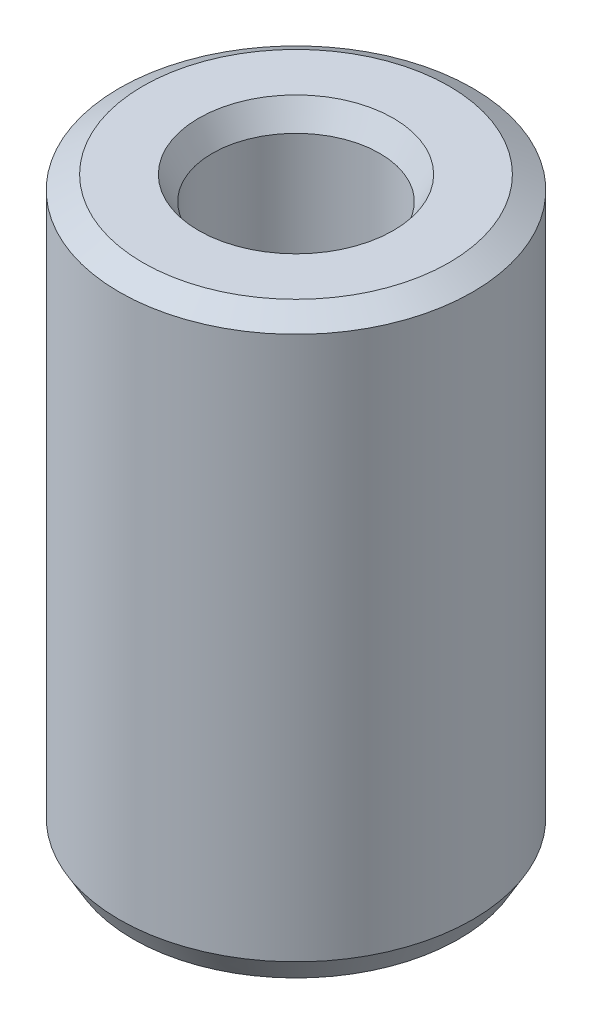
ISO-10303-21;
HEADER;
FILE_DESCRIPTION(('STEP AP214'),'2;1');
FILE_NAME('part.step','',(''),(''),'','','');
FILE_SCHEMA(('AUTOMOTIVE_DESIGN { 1 0 10303 214 1 1 1 1 }'));
ENDSEC;
DATA;
#1=APPLICATION_CONTEXT('core data for automotive mechanical design processes');
#2=APPLICATION_PROTOCOL_DEFINITION('international standard','automotive_design',2000,#1);
#3=PRODUCT_CONTEXT('',#1,'mechanical');
#4=PRODUCT('Part','Part','',(#3));
#5=PRODUCT_RELATED_PRODUCT_CATEGORY('part','',(#4));
#6=PRODUCT_DEFINITION_FORMATION('','',#4);
#7=PRODUCT_DEFINITION_CONTEXT('part definition',#1,'design');
#8=PRODUCT_DEFINITION('design','',#6,#7);
#9=PRODUCT_DEFINITION_SHAPE('','',#8);
#10=(LENGTH_UNIT() NAMED_UNIT(*) SI_UNIT(.MILLI.,.METRE.));
#11=(NAMED_UNIT(*) PLANE_ANGLE_UNIT() SI_UNIT($,.RADIAN.));
#12=(NAMED_UNIT(*) SI_UNIT($,.STERADIAN.) SOLID_ANGLE_UNIT());
#13=UNCERTAINTY_MEASURE_WITH_UNIT(LENGTH_MEASURE(1.E-05),#10,'distance_accuracy_value','');
#14=(GEOMETRIC_REPRESENTATION_CONTEXT(3) GLOBAL_UNCERTAINTY_ASSIGNED_CONTEXT((#13)) GLOBAL_UNIT_ASSIGNED_CONTEXT((#10,
#11,#12)) REPRESENTATION_CONTEXT('',''));
#15=CARTESIAN_POINT('',(0.,0.,0.));
#16=DIRECTION('',(0.,0.,1.));
#17=DIRECTION('',(1.,0.,0.));
#18=AXIS2_PLACEMENT_3D('',#15,#16,#17);
#19=CARTESIAN_POINT('',(0.,115.049599353986,0.));
#20=DIRECTION('',(0.,-1.,0.));
#21=DIRECTION('',(0.,0.,-1.));
#22=AXIS2_PLACEMENT_3D('',#19,#20,#21);
#23=CYLINDRICAL_SURFACE('',#22,35.);
#24=CARTESIAN_POINT('',(0.,4.67939836817344,0.));
#25=DIRECTION('',(0.,1.,0.));
#26=DIRECTION('',(0.,0.,1.));
#27=AXIS2_PLACEMENT_3D('',#24,#25,#26);
#28=CIRCLE('',#27,35.);
#29=CARTESIAN_POINT('',(0.,4.67939836817344,-35.));
#30=VERTEX_POINT('',#29);
#31=EDGE_CURVE('E10',#30,#30,#28,.T.);
#32=CARTESIAN_POINT('',(0.,112.347947446476,0.));
#33=DIRECTION('',(0.,1.,0.));
#34=DIRECTION('',(0.,0.,1.));
#35=AXIS2_PLACEMENT_3D('',#32,#33,#34);
#36=CIRCLE('',#35,35.);
#37=CARTESIAN_POINT('',(0.,112.347947446476,-35.));
#38=VERTEX_POINT('',#37);
#39=EDGE_CURVE('E50',#38,#38,#36,.F.);
#40=CARTESIAN_POINT('',(0.,4.67939836817344,-35.));
#41=CARTESIAN_POINT('',(0.,5.80094575440575,-35.));
#42=CARTESIAN_POINT('',(0.,6.92249314063807,-35.));
#43=CARTESIAN_POINT('',(0.,9.1655879131027,-35.));
#44=CARTESIAN_POINT('',(0.,10.287135299335,-35.));
#45=CARTESIAN_POINT('',(0.,12.5302300717996,-35.));
#46=CARTESIAN_POINT('',(0.,13.6517774580319,-35.));
#47=CARTESIAN_POINT('',(0.,15.8948722304966,-35.));
#48=CARTESIAN_POINT('',(0.,17.0164196167289,-35.));
#49=CARTESIAN_POINT('',(0.,19.2595143891935,-35.));
#50=CARTESIAN_POINT('',(0.,20.3810617754258,-35.));
#51=CARTESIAN_POINT('',(0.,22.6241565478905,-35.));
#52=CARTESIAN_POINT('',(0.,23.7457039341228,-35.));
#53=CARTESIAN_POINT('',(0.,25.9887987065874,-35.));
#54=CARTESIAN_POINT('',(0.,27.1103460928197,-35.));
#55=CARTESIAN_POINT('',(0.,29.3534408652843,-35.));
#56=CARTESIAN_POINT('',(0.,30.4749882515167,-35.));
#57=CARTESIAN_POINT('',(0.,32.7180830239813,-35.));
#58=CARTESIAN_POINT('',(0.,33.8396304102136,-35.));
#59=CARTESIAN_POINT('',(0.,36.0827251826782,-35.));
#60=CARTESIAN_POINT('',(0.,37.2042725689105,-35.));
#61=CARTESIAN_POINT('',(0.,39.4473673413752,-35.));
#62=CARTESIAN_POINT('',(0.,40.5689147276075,-35.));
#63=CARTESIAN_POINT('',(0.,42.8120095000721,-35.));
#64=CARTESIAN_POINT('',(0.,43.9335568863044,-35.));
#65=CARTESIAN_POINT('',(0.,46.1766516587691,-35.));
#66=CARTESIAN_POINT('',(0.,47.2981990450014,-35.));
#67=CARTESIAN_POINT('',(0.,49.541293817466,-35.));
#68=CARTESIAN_POINT('',(0.,50.6628412036983,-35.));
#69=CARTESIAN_POINT('',(0.,52.9059359761629,-35.));
#70=CARTESIAN_POINT('',(0.,54.0274833623952,-35.));
#71=CARTESIAN_POINT('',(0.,56.2705781348599,-35.));
#72=CARTESIAN_POINT('',(0.,57.3921255210922,-35.));
#73=CARTESIAN_POINT('',(0.,59.6352202935568,-35.));
#74=CARTESIAN_POINT('',(0.,60.7567676797891,-35.));
#75=CARTESIAN_POINT('',(0.,62.9998624522538,-35.));
#76=CARTESIAN_POINT('',(0.,64.1214098384861,-35.));
#77=CARTESIAN_POINT('',(0.,66.3645046109507,-35.));
#78=CARTESIAN_POINT('',(0.,67.486051997183,-35.));
#79=CARTESIAN_POINT('',(0.,69.7291467696476,-35.));
#80=CARTESIAN_POINT('',(0.,70.8506941558799,-35.));
#81=CARTESIAN_POINT('',(0.,73.0937889283446,-35.));
#82=CARTESIAN_POINT('',(0.,74.2153363145769,-35.));
#83=CARTESIAN_POINT('',(0.,76.4584310870415,-35.));
#84=CARTESIAN_POINT('',(0.,77.5799784732738,-35.));
#85=CARTESIAN_POINT('',(0.,79.8230732457385,-35.));
#86=CARTESIAN_POINT('',(0.,80.9446206319708,-35.));
#87=CARTESIAN_POINT('',(0.,83.1877154044354,-35.));
#88=CARTESIAN_POINT('',(0.,84.3092627906677,-35.));
#89=CARTESIAN_POINT('',(0.,86.5523575631323,-35.));
#90=CARTESIAN_POINT('',(0.,87.6739049493647,-35.));
#91=CARTESIAN_POINT('',(0.,89.9169997218293,-35.));
#92=CARTESIAN_POINT('',(0.,91.0385471080616,-35.));
#93=CARTESIAN_POINT('',(0.,93.2816418805262,-35.));
#94=CARTESIAN_POINT('',(0.,94.4031892667585,-35.));
#95=CARTESIAN_POINT('',(0.,96.6462840392232,-35.));
#96=CARTESIAN_POINT('',(0.,97.7678314254555,-35.));
#97=CARTESIAN_POINT('',(0.,100.01092619792,-35.));
#98=CARTESIAN_POINT('',(0.,101.132473584152,-35.));
#99=CARTESIAN_POINT('',(0.,103.375568356617,-35.));
#100=CARTESIAN_POINT('',(0.,104.497115742849,-35.));
#101=CARTESIAN_POINT('',(0.,106.740210515314,-35.));
#102=CARTESIAN_POINT('',(0.,107.861757901546,-35.));
#103=CARTESIAN_POINT('',(0.,110.104852674011,-35.));
#104=CARTESIAN_POINT('',(0.,111.226400060243,-35.));
#105=CARTESIAN_POINT('',(0.,112.347947446476,-35.));
#106=B_SPLINE_CURVE_WITH_KNOTS('',3,(#40,#41,#42,#43,#44,#45,#46,#47,#48,#49,#50,#51,#52,#53,
#54,#55,#56,#57,#58,#59,#60,#61,#62,#63,#64,#65,#66,#67,#68,#69,#70,#71,#72,#73,#74,#75,#76,#77,
#78,#79,#80,#81,#82,#83,#84,#85,#86,#87,#88,#89,#90,#91,#92,#93,#94,#95,#96,#97,#98,#99,#100,
#101,#102,#103,#104,#105),.UNSPECIFIED.,.F.,.F.,(4,2,2,2,2,2,2,2,2,2,2,2,2,2,2,2,2,2,2,2,2,2,2,
2,2,2,2,2,2,2,2,2,4),(0.,3.36464215869695,6.72928431739389,10.0939264760908,13.4585686347878,
16.8232107934847,20.1878529521816,23.5524951108786,26.9171372695755,30.2817794282725,
33.6464215869694,37.0110637456664,40.3757059043633,43.7403480630603,47.1049902217572,
50.4696323804541,53.8342745391511,57.198916697848,60.563558856545,63.9282010152419,
67.2928431739388,70.6574853326358,74.0221274913327,77.3867696500297,80.7514118087266,
84.1160539674235,87.4806961261205,90.8453382848174,94.2099804435144,97.5746226022113,
100.939264760908,104.303906919605,107.668549078302),.UNSPECIFIED.);
#107=EDGE_CURVE('BSEAM39',#30,#38,#106,.T.);
#108=ORIENTED_EDGE('',*,*,#31,.T.);
#109=ORIENTED_EDGE('',*,*,#39,.T.);
#110=ORIENTED_EDGE('',*,*,#107,.T.);
#111=ORIENTED_EDGE('',*,*,#107,.F.);
#112=EDGE_LOOP('',(#108,#110,#109,#111));
#113=FACE_BOUND('',#112,.T.);
#114=ADVANCED_FACE('F39',(#113),#23,.T.);
#115=CARTESIAN_POINT('',(0.,115.049599353986,0.));
#116=DIRECTION('',(0.,1.,0.));
#117=DIRECTION('',(0.,0.,1.));
#118=AXIS2_PLACEMENT_3D('',#115,#116,#117);
#119=PLANE('',#118);
#120=CARTESIAN_POINT('',(0.,115.049599353986,0.));
#121=DIRECTION('',(0.,1.,0.));
#122=DIRECTION('',(0.,0.,1.));
#123=AXIS2_PLACEMENT_3D('',#120,#121,#122);
#124=CIRCLE('',#123,19.2877611381571);
#125=CARTESIAN_POINT('',(0.,115.049599353986,19.2877611381571));
#126=VERTEX_POINT('',#125);
#127=EDGE_CURVE('E58',#126,#126,#124,.F.);
#128=ORIENTED_EDGE('',*,*,#127,.T.);
#129=EDGE_LOOP('',(#128));
#130=FACE_BOUND('',#129,.T.);
#131=CARTESIAN_POINT('',(0.,115.049599353986,0.));
#132=DIRECTION('',(0.,1.,0.));
#133=DIRECTION('',(0.,0.,1.));
#134=AXIS2_PLACEMENT_3D('',#131,#132,#133);
#135=CIRCLE('',#134,30.3206016318269);
#136=CARTESIAN_POINT('',(0.,115.049599353986,30.3206016318269));
#137=VERTEX_POINT('',#136);
#138=EDGE_CURVE('E61',#137,#137,#135,.T.);
#139=ORIENTED_EDGE('',*,*,#138,.T.);
#140=EDGE_LOOP('',(#139));
#141=FACE_BOUND('',#140,.T.);
#142=ADVANCED_FACE('F88',(#130,#141),#119,.T.);
#143=CARTESIAN_POINT('',(0.,0.,0.));
#144=DIRECTION('',(0.,1.,0.));
#145=DIRECTION('',(0.,0.,1.));
#146=AXIS2_PLACEMENT_3D('',#143,#144,#145);
#147=PLANE('',#146);
#148=CARTESIAN_POINT('',(0.,0.,0.));
#149=DIRECTION('',(0.,1.,0.));
#150=DIRECTION('',(0.,0.,1.));
#151=AXIS2_PLACEMENT_3D('',#148,#149,#150);
#152=CIRCLE('',#151,21.2655075988197);
#153=CARTESIAN_POINT('',(0.,0.,21.2655075988197));
#154=VERTEX_POINT('',#153);
#155=EDGE_CURVE('E51',#154,#154,#152,.T.);
#156=ORIENTED_EDGE('',*,*,#155,.T.);
#157=EDGE_LOOP('',(#156));
#158=FACE_BOUND('',#157,.T.);
#159=CARTESIAN_POINT('',(0.,0.,0.));
#160=DIRECTION('',(0.,1.,0.));
#161=DIRECTION('',(0.,0.,1.));
#162=AXIS2_PLACEMENT_3D('',#159,#160,#161);
#163=CIRCLE('',#162,32.2983480924896);
#164=CARTESIAN_POINT('',(0.,0.,32.2983480924896));
#165=VERTEX_POINT('',#164);
#166=EDGE_CURVE('E54',#165,#165,#163,.F.);
#167=ORIENTED_EDGE('',*,*,#166,.T.);
#168=EDGE_LOOP('',(#167));
#169=FACE_BOUND('',#168,.T.);
#170=ADVANCED_FACE('F83',(#158,#169),#147,.F.);
#171=CARTESIAN_POINT('',(0.,115.049599353986,0.));
#172=DIRECTION('',(0.,-1.,0.));
#173=DIRECTION('',(0.,0.,-1.));
#174=AXIS2_PLACEMENT_3D('',#171,#172,#173);
#175=CYLINDRICAL_SURFACE('',#174,16.5861092306466);
#176=CARTESIAN_POINT('',(0.,110.370200985812,0.));
#177=DIRECTION('',(0.,1.,0.));
#178=DIRECTION('',(0.,0.,1.));
#179=AXIS2_PLACEMENT_3D('',#176,#177,#178);
#180=CIRCLE('',#179,16.5861092306466);
#181=CARTESIAN_POINT('',(0.,110.370200985812,-16.5861092306466));
#182=VERTEX_POINT('',#181);
#183=EDGE_CURVE('E67',#182,#182,#180,.T.);
#184=CARTESIAN_POINT('',(0.,2.70165190751029,0.));
#185=DIRECTION('',(0.,1.,0.));
#186=DIRECTION('',(0.,0.,1.));
#187=AXIS2_PLACEMENT_3D('',#184,#185,#186);
#188=CIRCLE('',#187,16.5861092306466);
#189=CARTESIAN_POINT('',(0.,2.70165190751029,-16.5861092306466));
#190=VERTEX_POINT('',#189);
#191=EDGE_CURVE('E69',#190,#190,#188,.F.);
#192=CARTESIAN_POINT('',(0.,110.370200985812,-16.5861092306466));
#193=CARTESIAN_POINT('',(0.,109.24865359958,-16.5861092306466));
#194=CARTESIAN_POINT('',(0.,108.127106213348,-16.5861092306466));
#195=CARTESIAN_POINT('',(0.,105.884011440883,-16.5861092306466));
#196=CARTESIAN_POINT('',(0.,104.762464054651,-16.5861092306466));
#197=CARTESIAN_POINT('',(0.,102.519369282186,-16.5861092306466));
#198=CARTESIAN_POINT('',(0.,101.397821895954,-16.5861092306466));
#199=CARTESIAN_POINT('',(0.,99.1547271234893,-16.5861092306466));
#200=CARTESIAN_POINT('',(0.,98.033179737257,-16.5861092306466));
#201=CARTESIAN_POINT('',(0.,95.7900849647923,-16.5861092306466));
#202=CARTESIAN_POINT('',(0.,94.66853757856,-16.5861092306466));
#203=CARTESIAN_POINT('',(0.,92.4254428060954,-16.5861092306466));
#204=CARTESIAN_POINT('',(0.,91.3038954198631,-16.5861092306466));
#205=CARTESIAN_POINT('',(0.,89.0608006473985,-16.5861092306466));
#206=CARTESIAN_POINT('',(0.,87.9392532611661,-16.5861092306466));
#207=CARTESIAN_POINT('',(0.,85.6961584887015,-16.5861092306466));
#208=CARTESIAN_POINT('',(0.,84.5746111024692,-16.5861092306466));
#209=CARTESIAN_POINT('',(0.,82.3315163300046,-16.5861092306466));
#210=CARTESIAN_POINT('',(0.,81.2099689437723,-16.5861092306466));
#211=CARTESIAN_POINT('',(0.,78.9668741713076,-16.5861092306466));
#212=CARTESIAN_POINT('',(0.,77.8453267850753,-16.5861092306466));
#213=CARTESIAN_POINT('',(0.,75.6022320126107,-16.5861092306466));
#214=CARTESIAN_POINT('',(0.,74.4806846263784,-16.5861092306466));
#215=CARTESIAN_POINT('',(0.,72.2375898539137,-16.5861092306466));
#216=CARTESIAN_POINT('',(0.,71.1160424676814,-16.5861092306466));
#217=CARTESIAN_POINT('',(0.,68.8729476952168,-16.5861092306466));
#218=CARTESIAN_POINT('',(0.,67.7514003089845,-16.5861092306466));
#219=CARTESIAN_POINT('',(0.,65.5083055365199,-16.5861092306466));
#220=CARTESIAN_POINT('',(0.,64.3867581502875,-16.5861092306466));
#221=CARTESIAN_POINT('',(0.,62.1436633778229,-16.5861092306466));
#222=CARTESIAN_POINT('',(0.,61.0221159915906,-16.5861092306466));
#223=CARTESIAN_POINT('',(0.,58.779021219126,-16.5861092306466));
#224=CARTESIAN_POINT('',(0.,57.6574738328937,-16.5861092306466));
#225=CARTESIAN_POINT('',(0.,55.414379060429,-16.5861092306466));
#226=CARTESIAN_POINT('',(0.,54.2928316741967,-16.5861092306466));
#227=CARTESIAN_POINT('',(0.,52.0497369017321,-16.5861092306466));
#228=CARTESIAN_POINT('',(0.,50.9281895154998,-16.5861092306466));
#229=CARTESIAN_POINT('',(0.,48.6850947430352,-16.5861092306466));
#230=CARTESIAN_POINT('',(0.,47.5635473568028,-16.5861092306466));
#231=CARTESIAN_POINT('',(0.,45.3204525843382,-16.5861092306466));
#232=CARTESIAN_POINT('',(0.,44.1989051981059,-16.5861092306466));
#233=CARTESIAN_POINT('',(0.,41.9558104256413,-16.5861092306466));
#234=CARTESIAN_POINT('',(0.,40.834263039409,-16.5861092306466));
#235=CARTESIAN_POINT('',(0.,38.5911682669443,-16.5861092306466));
#236=CARTESIAN_POINT('',(0.,37.469620880712,-16.5861092306466));
#237=CARTESIAN_POINT('',(0.,35.2265261082474,-16.5861092306466));
#238=CARTESIAN_POINT('',(0.,34.1049787220151,-16.5861092306466));
#239=CARTESIAN_POINT('',(0.,31.8618839495505,-16.5861092306466));
#240=CARTESIAN_POINT('',(0.,30.7403365633181,-16.5861092306466));
#241=CARTESIAN_POINT('',(0.,28.4972417908535,-16.5861092306466));
#242=CARTESIAN_POINT('',(0.,27.3756944046212,-16.5861092306466));
#243=CARTESIAN_POINT('',(0.,25.1325996321566,-16.5861092306466));
#244=CARTESIAN_POINT('',(0.,24.0110522459242,-16.5861092306466));
#245=CARTESIAN_POINT('',(0.,21.7679574734596,-16.5861092306466));
#246=CARTESIAN_POINT('',(0.,20.6464100872273,-16.5861092306466));
#247=CARTESIAN_POINT('',(0.,18.4033153147627,-16.5861092306466));
#248=CARTESIAN_POINT('',(0.,17.2817679285304,-16.5861092306466));
#249=CARTESIAN_POINT('',(0.,15.0386731560657,-16.5861092306466));
#250=CARTESIAN_POINT('',(0.,13.9171257698334,-16.5861092306466));
#251=CARTESIAN_POINT('',(0.,11.6740309973688,-16.5861092306466));
#252=CARTESIAN_POINT('',(0.,10.5524836111365,-16.5861092306466));
#253=CARTESIAN_POINT('',(0.,8.30938883867186,-16.5861092306466));
#254=CARTESIAN_POINT('',(0.,7.18784145243955,-16.5861092306466));
#255=CARTESIAN_POINT('',(0.,4.94474667997492,-16.5861092306466));
#256=CARTESIAN_POINT('',(0.,3.8231992937426,-16.5861092306466));
#257=CARTESIAN_POINT('',(0.,2.70165190751029,-16.5861092306466));
#258=B_SPLINE_CURVE_WITH_KNOTS('',3,(#192,#193,#194,#195,#196,#197,#198,#199,#200,#201,#202,
#203,#204,#205,#206,#207,#208,#209,#210,#211,#212,#213,#214,#215,#216,#217,#218,#219,#220,#221,
#222,#223,#224,#225,#226,#227,#228,#229,#230,#231,#232,#233,#234,#235,#236,#237,#238,#239,#240,
#241,#242,#243,#244,#245,#246,#247,#248,#249,#250,#251,#252,#253,#254,#255,#256,#257),
.UNSPECIFIED.,.F.,.F.,(4,2,2,2,2,2,2,2,2,2,2,2,2,2,2,2,2,2,2,2,2,2,2,2,2,2,2,2,2,2,2,2,4),(0.,
3.36464215869695,6.72928431739389,10.0939264760908,13.4585686347878,16.8232107934847,
20.1878529521817,23.5524951108786,26.9171372695755,30.2817794282725,33.6464215869694,
37.0110637456664,40.3757059043633,43.7403480630603,47.1049902217572,50.4696323804541,
53.8342745391511,57.198916697848,60.563558856545,63.9282010152419,67.2928431739388,
70.6574853326358,74.0221274913327,77.3867696500296,80.7514118087266,84.1160539674235,
87.4806961261205,90.8453382848174,94.2099804435144,97.5746226022113,100.939264760908,
104.303906919605,107.668549078302),.UNSPECIFIED.);
#259=EDGE_CURVE('BSEAM71',#182,#190,#258,.T.);
#260=ORIENTED_EDGE('',*,*,#183,.T.);
#261=ORIENTED_EDGE('',*,*,#191,.T.);
#262=ORIENTED_EDGE('',*,*,#259,.T.);
#263=ORIENTED_EDGE('',*,*,#259,.F.);
#264=EDGE_LOOP('',(#260,#262,#261,#263));
#265=FACE_BOUND('',#264,.T.);
#266=ADVANCED_FACE('F71',(#265),#175,.F.);
#267=CARTESIAN_POINT('',(0.,110.370200985812,0.));
#268=DIRECTION('',(0.,1.,0.));
#269=DIRECTION('',(0.,0.,1.));
#270=AXIS2_PLACEMENT_3D('',#267,#268,#269);
#271=CONICAL_SURFACE('',#270,16.5861092306466,0.523598775598304);
#272=ORIENTED_EDGE('',*,*,#127,.F.);
#273=EDGE_LOOP('',(#272));
#274=FACE_BOUND('',#273,.T.);
#275=ORIENTED_EDGE('',*,*,#183,.F.);
#276=EDGE_LOOP('',(#275));
#277=FACE_BOUND('',#276,.T.);
#278=ADVANCED_FACE('F77',(#274,#277),#271,.F.);
#279=CARTESIAN_POINT('',(0.,0.,0.));
#280=DIRECTION('',(0.,-1.,0.));
#281=DIRECTION('',(0.,0.,-1.));
#282=AXIS2_PLACEMENT_3D('',#279,#280,#281);
#283=CONICAL_SURFACE('',#282,21.2655075988197,1.04719755119659);
#284=ORIENTED_EDGE('',*,*,#191,.F.);
#285=EDGE_LOOP('',(#284));
#286=FACE_BOUND('',#285,.T.);
#287=ORIENTED_EDGE('',*,*,#155,.F.);
#288=EDGE_LOOP('',(#287));
#289=FACE_BOUND('',#288,.T.);
#290=ADVANCED_FACE('F73',(#286,#289),#283,.F.);
#291=CARTESIAN_POINT('',(0.,4.67939836817344,0.));
#292=DIRECTION('',(0.,1.,0.));
#293=DIRECTION('',(0.,0.,1.));
#294=AXIS2_PLACEMENT_3D('',#291,#292,#293);
#295=CONICAL_SURFACE('',#294,35.,0.523598775598303);
#296=ORIENTED_EDGE('',*,*,#166,.F.);
#297=EDGE_LOOP('',(#296));
#298=FACE_BOUND('',#297,.T.);
#299=ORIENTED_EDGE('',*,*,#31,.F.);
#300=EDGE_LOOP('',(#299));
#301=FACE_BOUND('',#300,.T.);
#302=ADVANCED_FACE('F76',(#298,#301),#295,.T.);
#303=CARTESIAN_POINT('',(0.,115.049599353986,0.));
#304=DIRECTION('',(0.,-1.,0.));
#305=DIRECTION('',(0.,0.,-1.));
#306=AXIS2_PLACEMENT_3D('',#303,#304,#305);
#307=CONICAL_SURFACE('',#306,30.3206016318269,1.0471975511966);
#308=ORIENTED_EDGE('',*,*,#39,.F.);
#309=EDGE_LOOP('',(#308));
#310=FACE_BOUND('',#309,.T.);
#311=ORIENTED_EDGE('',*,*,#138,.F.);
#312=EDGE_LOOP('',(#311));
#313=FACE_BOUND('',#312,.T.);
#314=ADVANCED_FACE('F45',(#310,#313),#307,.T.);
#315=CLOSED_SHELL('',(#114,#142,#170,#266,#278,#290,#302,#314));
#316=MANIFOLD_SOLID_BREP('B2',#315);
#317=ADVANCED_BREP_SHAPE_REPRESENTATION('',(#18,#316),#14);
#318=SHAPE_DEFINITION_REPRESENTATION(#9,#317);
ENDSEC;
END-ISO-10303-21;
